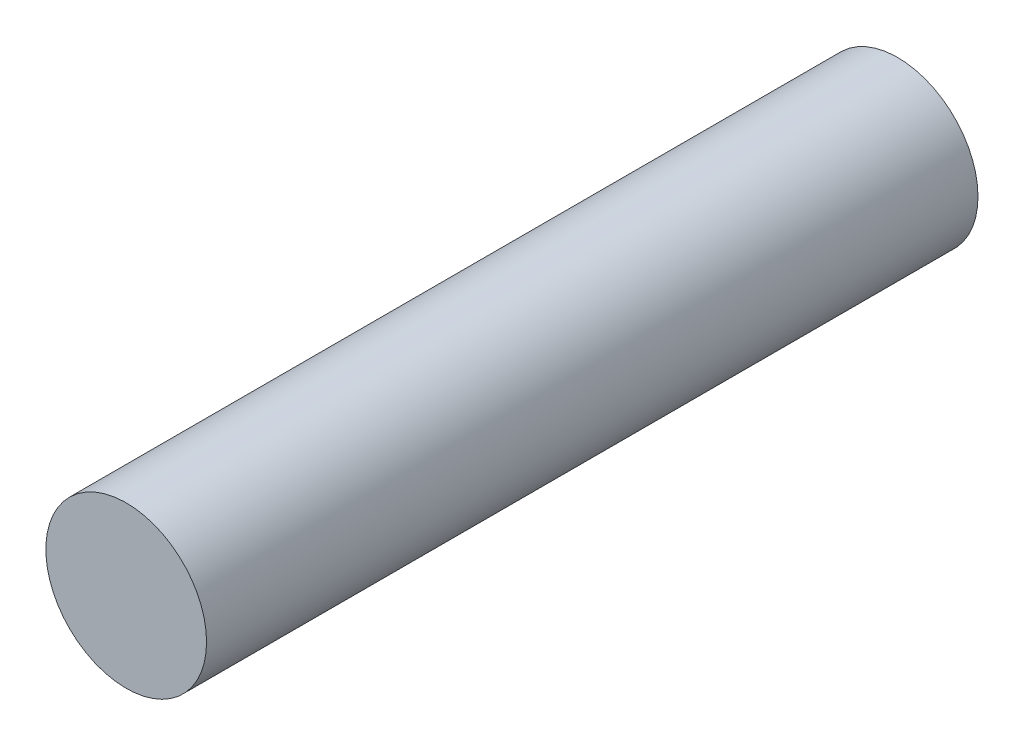
ISO-10303-21;
HEADER;
FILE_DESCRIPTION(('STEP AP214'),'2;1');
FILE_NAME('part.step','',(''),(''),'','','');
FILE_SCHEMA(('AUTOMOTIVE_DESIGN { 1 0 10303 214 1 1 1 1 }'));
ENDSEC;
DATA;
#1=APPLICATION_CONTEXT('core data for automotive mechanical design processes');
#2=APPLICATION_PROTOCOL_DEFINITION('international standard','automotive_design',2000,#1);
#3=PRODUCT_CONTEXT('',#1,'mechanical');
#4=PRODUCT('Part','Part','',(#3));
#5=PRODUCT_RELATED_PRODUCT_CATEGORY('part','',(#4));
#6=PRODUCT_DEFINITION_FORMATION('','',#4);
#7=PRODUCT_DEFINITION_CONTEXT('part definition',#1,'design');
#8=PRODUCT_DEFINITION('design','',#6,#7);
#9=PRODUCT_DEFINITION_SHAPE('','',#8);
#10=(LENGTH_UNIT() NAMED_UNIT(*) SI_UNIT(.MILLI.,.METRE.));
#11=(NAMED_UNIT(*) PLANE_ANGLE_UNIT() SI_UNIT($,.RADIAN.));
#12=(NAMED_UNIT(*) SI_UNIT($,.STERADIAN.) SOLID_ANGLE_UNIT());
#13=UNCERTAINTY_MEASURE_WITH_UNIT(LENGTH_MEASURE(1.E-05),#10,'distance_accuracy_value','');
#14=(GEOMETRIC_REPRESENTATION_CONTEXT(3) GLOBAL_UNCERTAINTY_ASSIGNED_CONTEXT((#13)) GLOBAL_UNIT_ASSIGNED_CONTEXT((#10,
#11,#12)) REPRESENTATION_CONTEXT('',''));
#15=CARTESIAN_POINT('',(0.,0.,0.));
#16=DIRECTION('',(0.,0.,1.));
#17=DIRECTION('',(1.,0.,0.));
#18=AXIS2_PLACEMENT_3D('',#15,#16,#17);
#19=CARTESIAN_POINT('',(0.,0.,24.));
#20=DIRECTION('',(0.,0.,-1.));
#21=DIRECTION('',(-1.,0.,0.));
#22=AXIS2_PLACEMENT_3D('',#19,#20,#21);
#23=CYLINDRICAL_SURFACE('',#22,2.5);
#24=CARTESIAN_POINT('',(0.,0.,24.));
#25=DIRECTION('',(0.,0.,1.));
#26=DIRECTION('',(1.,0.,0.));
#27=AXIS2_PLACEMENT_3D('',#24,#25,#26);
#28=CIRCLE('',#27,2.5);
#29=CARTESIAN_POINT('',(2.5,0.,24.));
#30=VERTEX_POINT('',#29);
#31=EDGE_CURVE('E10',#30,#30,#28,.T.);
#32=ORIENTED_EDGE('',*,*,#31,.F.);
#33=EDGE_LOOP('',(#32));
#34=FACE_BOUND('',#33,.T.);
#35=CARTESIAN_POINT('',(0.,0.,0.));
#36=DIRECTION('',(0.,0.,1.));
#37=DIRECTION('',(1.,0.,0.));
#38=AXIS2_PLACEMENT_3D('',#35,#36,#37);
#39=CIRCLE('',#38,2.5);
#40=CARTESIAN_POINT('',(2.5,0.,0.));
#41=VERTEX_POINT('',#40);
#42=EDGE_CURVE('E33',#41,#41,#39,.T.);
#43=ORIENTED_EDGE('',*,*,#42,.T.);
#44=EDGE_LOOP('',(#43));
#45=FACE_BOUND('',#44,.T.);
#46=ADVANCED_FACE('F30',(#34,#45),#23,.T.);
#47=CARTESIAN_POINT('',(0.,0.,24.));
#48=DIRECTION('',(0.,0.,1.));
#49=DIRECTION('',(1.,0.,0.));
#50=AXIS2_PLACEMENT_3D('',#47,#48,#49);
#51=PLANE('',#50);
#52=ORIENTED_EDGE('',*,*,#31,.T.);
#53=EDGE_LOOP('',(#52));
#54=FACE_BOUND('',#53,.T.);
#55=ADVANCED_FACE('F45',(#54),#51,.T.);
#56=CARTESIAN_POINT('',(0.,0.,0.));
#57=DIRECTION('',(0.,0.,1.));
#58=DIRECTION('',(1.,0.,0.));
#59=AXIS2_PLACEMENT_3D('',#56,#57,#58);
#60=PLANE('',#59);
#61=ORIENTED_EDGE('',*,*,#42,.F.);
#62=EDGE_LOOP('',(#61));
#63=FACE_BOUND('',#62,.T.);
#64=ADVANCED_FACE('F43',(#63),#60,.F.);
#65=CLOSED_SHELL('',(#46,#55,#64));
#66=MANIFOLD_SOLID_BREP('B2',#65);
#67=ADVANCED_BREP_SHAPE_REPRESENTATION('',(#18,#66),#14);
#68=SHAPE_DEFINITION_REPRESENTATION(#9,#67);
ENDSEC;
END-ISO-10303-21;
